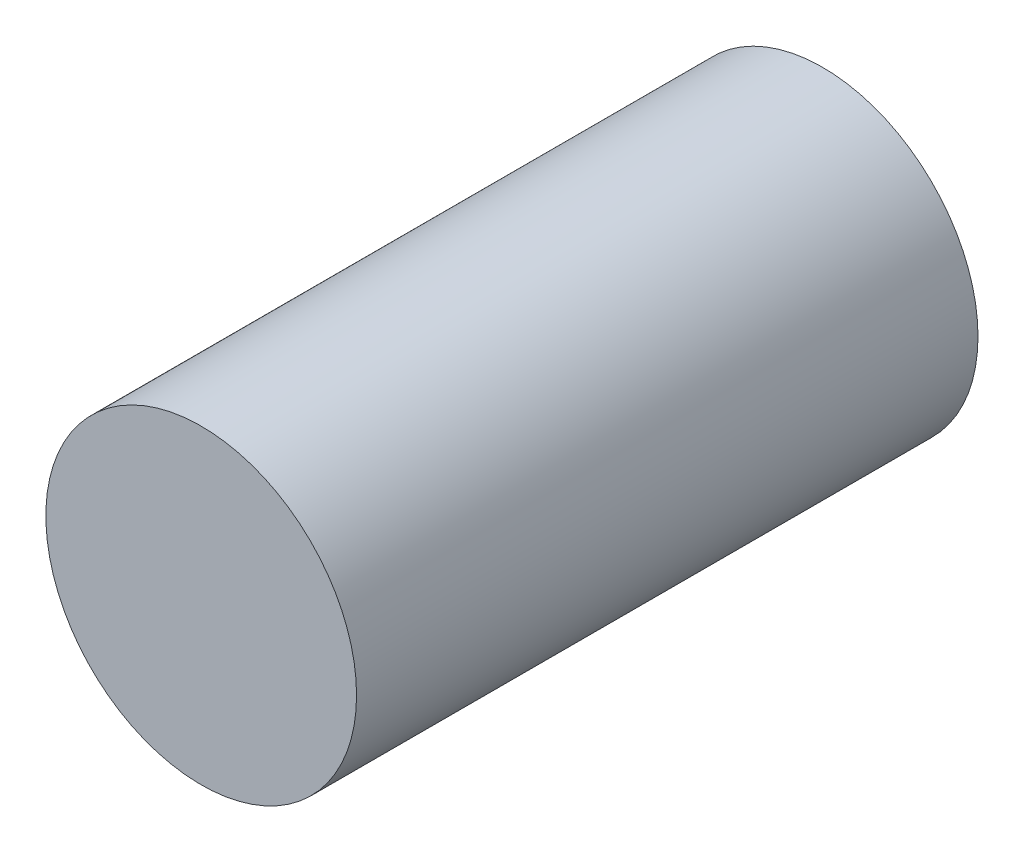
ISO-10303-21;
HEADER;
FILE_DESCRIPTION(('STEP AP214'),'2;1');
FILE_NAME('part.step','',(''),(''),'','','');
FILE_SCHEMA(('AUTOMOTIVE_DESIGN { 1 0 10303 214 1 1 1 1 }'));
ENDSEC;
DATA;
#1=APPLICATION_CONTEXT('core data for automotive mechanical design processes');
#2=APPLICATION_PROTOCOL_DEFINITION('international standard','automotive_design',2000,#1);
#3=PRODUCT_CONTEXT('',#1,'mechanical');
#4=PRODUCT('Part','Part','',(#3));
#5=PRODUCT_RELATED_PRODUCT_CATEGORY('part','',(#4));
#6=PRODUCT_DEFINITION_FORMATION('','',#4);
#7=PRODUCT_DEFINITION_CONTEXT('part definition',#1,'design');
#8=PRODUCT_DEFINITION('design','',#6,#7);
#9=PRODUCT_DEFINITION_SHAPE('','',#8);
#10=(LENGTH_UNIT() NAMED_UNIT(*) SI_UNIT(.MILLI.,.METRE.));
#11=(NAMED_UNIT(*) PLANE_ANGLE_UNIT() SI_UNIT($,.RADIAN.));
#12=(NAMED_UNIT(*) SI_UNIT($,.STERADIAN.) SOLID_ANGLE_UNIT());
#13=UNCERTAINTY_MEASURE_WITH_UNIT(LENGTH_MEASURE(1.E-05),#10,'distance_accuracy_value','');
#14=(GEOMETRIC_REPRESENTATION_CONTEXT(3) GLOBAL_UNCERTAINTY_ASSIGNED_CONTEXT((#13)) GLOBAL_UNIT_ASSIGNED_CONTEXT((#10,
#11,#12)) REPRESENTATION_CONTEXT('',''));
#15=CARTESIAN_POINT('',(0.,0.,0.));
#16=DIRECTION('',(0.,0.,1.));
#17=DIRECTION('',(1.,0.,0.));
#18=AXIS2_PLACEMENT_3D('',#15,#16,#17);
#19=CARTESIAN_POINT('',(0.,0.,4.));
#20=DIRECTION('',(0.,0.,-1.));
#21=DIRECTION('',(-1.,0.,0.));
#22=AXIS2_PLACEMENT_3D('',#19,#20,#21);
#23=CYLINDRICAL_SURFACE('',#22,1.);
#24=CARTESIAN_POINT('',(0.,0.,4.));
#25=DIRECTION('',(0.,0.,1.));
#26=DIRECTION('',(1.,0.,0.));
#27=AXIS2_PLACEMENT_3D('',#24,#25,#26);
#28=CIRCLE('',#27,1.);
#29=CARTESIAN_POINT('',(1.,0.,4.));
#30=VERTEX_POINT('',#29);
#31=EDGE_CURVE('E10',#30,#30,#28,.T.);
#32=ORIENTED_EDGE('',*,*,#31,.F.);
#33=EDGE_LOOP('',(#32));
#34=FACE_BOUND('',#33,.T.);
#35=CARTESIAN_POINT('',(0.,0.,0.));
#36=DIRECTION('',(0.,0.,1.));
#37=DIRECTION('',(1.,0.,0.));
#38=AXIS2_PLACEMENT_3D('',#35,#36,#37);
#39=CIRCLE('',#38,1.);
#40=CARTESIAN_POINT('',(1.,0.,0.));
#41=VERTEX_POINT('',#40);
#42=EDGE_CURVE('E38',#41,#41,#39,.T.);
#43=ORIENTED_EDGE('',*,*,#42,.T.);
#44=EDGE_LOOP('',(#43));
#45=FACE_BOUND('',#44,.T.);
#46=ADVANCED_FACE('F35',(#34,#45),#23,.T.);
#47=CARTESIAN_POINT('',(0.,0.,4.));
#48=DIRECTION('',(0.,0.,1.));
#49=DIRECTION('',(1.,0.,0.));
#50=AXIS2_PLACEMENT_3D('',#47,#48,#49);
#51=PLANE('',#50);
#52=ORIENTED_EDGE('',*,*,#31,.T.);
#53=EDGE_LOOP('',(#52));
#54=FACE_BOUND('',#53,.T.);
#55=ADVANCED_FACE('F50',(#54),#51,.T.);
#56=CARTESIAN_POINT('',(0.,0.,0.));
#57=DIRECTION('',(0.,0.,1.));
#58=DIRECTION('',(1.,0.,0.));
#59=AXIS2_PLACEMENT_3D('',#56,#57,#58);
#60=PLANE('',#59);
#61=ORIENTED_EDGE('',*,*,#42,.F.);
#62=EDGE_LOOP('',(#61));
#63=FACE_BOUND('',#62,.T.);
#64=ADVANCED_FACE('F48',(#63),#60,.F.);
#65=CLOSED_SHELL('',(#46,#55,#64));
#66=MANIFOLD_SOLID_BREP('B2',#65);
#67=ADVANCED_BREP_SHAPE_REPRESENTATION('',(#18,#66),#14);
#68=SHAPE_DEFINITION_REPRESENTATION(#9,#67);
ENDSEC;
END-ISO-10303-21;
